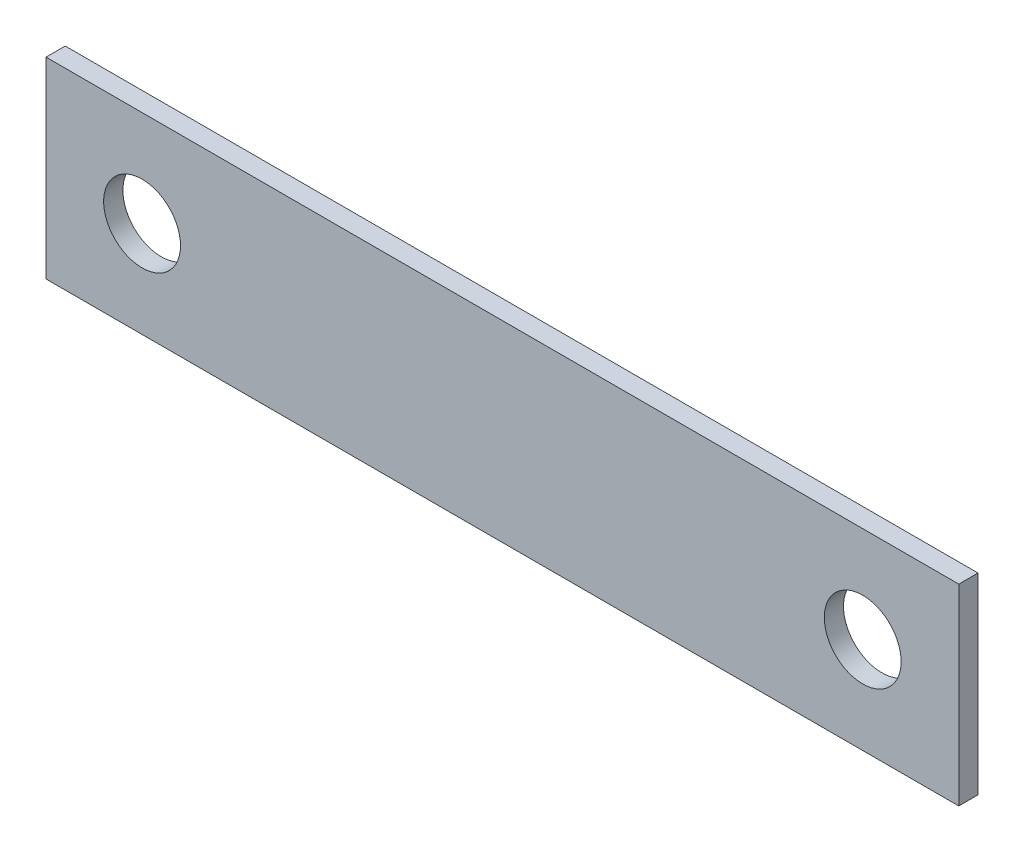
ISO-10303-21;
HEADER;
FILE_DESCRIPTION(('STEP AP214'),'2;1');
FILE_NAME('part.step','',(''),(''),'','','');
FILE_SCHEMA(('AUTOMOTIVE_DESIGN { 1 0 10303 214 1 1 1 1 }'));
ENDSEC;
DATA;
#1=APPLICATION_CONTEXT('core data for automotive mechanical design processes');
#2=APPLICATION_PROTOCOL_DEFINITION('international standard','automotive_design',2000,#1);
#3=PRODUCT_CONTEXT('',#1,'mechanical');
#4=PRODUCT('Part','Part','',(#3));
#5=PRODUCT_RELATED_PRODUCT_CATEGORY('part','',(#4));
#6=PRODUCT_DEFINITION_FORMATION('','',#4);
#7=PRODUCT_DEFINITION_CONTEXT('part definition',#1,'design');
#8=PRODUCT_DEFINITION('design','',#6,#7);
#9=PRODUCT_DEFINITION_SHAPE('','',#8);
#10=(LENGTH_UNIT() NAMED_UNIT(*) SI_UNIT(.MILLI.,.METRE.));
#11=(NAMED_UNIT(*) PLANE_ANGLE_UNIT() SI_UNIT($,.RADIAN.));
#12=(NAMED_UNIT(*) SI_UNIT($,.STERADIAN.) SOLID_ANGLE_UNIT());
#13=UNCERTAINTY_MEASURE_WITH_UNIT(LENGTH_MEASURE(1.E-05),#10,'distance_accuracy_value','');
#14=(GEOMETRIC_REPRESENTATION_CONTEXT(3) GLOBAL_UNCERTAINTY_ASSIGNED_CONTEXT((#13)) GLOBAL_UNIT_ASSIGNED_CONTEXT((#10,
#11,#12)) REPRESENTATION_CONTEXT('',''));
#15=CARTESIAN_POINT('',(0.,0.,0.));
#16=DIRECTION('',(0.,0.,1.));
#17=DIRECTION('',(1.,0.,0.));
#18=AXIS2_PLACEMENT_3D('',#15,#16,#17);
#19=CARTESIAN_POINT('',(47.5,-10.,0.));
#20=DIRECTION('',(1.,0.,0.));
#21=DIRECTION('',(0.,1.,0.));
#22=AXIS2_PLACEMENT_3D('',#19,#20,#21);
#23=PLANE('',#22);
#24=DIRECTION('',(0.,0.,1.));
#25=VECTOR('',#24,1.);
#26=CARTESIAN_POINT('',(47.5,-10.,0.));
#27=LINE('',#26,#25);
#28=CARTESIAN_POINT('',(47.5,-10.,-2.));
#29=VERTEX_POINT('',#28);
#30=CARTESIAN_POINT('',(47.5,-10.,0.));
#31=VERTEX_POINT('',#30);
#32=EDGE_CURVE('E11',#29,#31,#27,.T.);
#33=ORIENTED_EDGE('',*,*,#32,.F.);
#34=DIRECTION('',(0.,1.,0.));
#35=VECTOR('',#34,1.);
#36=CARTESIAN_POINT('',(47.5,0.,-2.));
#37=LINE('',#36,#35);
#38=CARTESIAN_POINT('',(47.5,10.,-2.));
#39=VERTEX_POINT('',#38);
#40=EDGE_CURVE('E91',#29,#39,#37,.T.);
#41=ORIENTED_EDGE('',*,*,#40,.T.);
#42=DIRECTION('',(0.,0.,1.));
#43=VECTOR('',#42,1.);
#44=CARTESIAN_POINT('',(47.5,10.,0.));
#45=LINE('',#44,#43);
#46=CARTESIAN_POINT('',(47.5,10.,0.));
#47=VERTEX_POINT('',#46);
#48=EDGE_CURVE('E47',#39,#47,#45,.T.);
#49=ORIENTED_EDGE('',*,*,#48,.T.);
#50=DIRECTION('',(0.,1.,0.));
#51=VECTOR('',#50,1.);
#52=CARTESIAN_POINT('',(47.5,-10.,0.));
#53=LINE('',#52,#51);
#54=EDGE_CURVE('E107',#31,#47,#53,.T.);
#55=ORIENTED_EDGE('',*,*,#54,.F.);
#56=EDGE_LOOP('',(#33,#41,#49,#55));
#57=FACE_BOUND('',#56,.T.);
#58=ADVANCED_FACE('F37',(#57),#23,.T.);
#59=CARTESIAN_POINT('',(47.5,10.,0.));
#60=DIRECTION('',(0.,1.,0.));
#61=DIRECTION('',(-1.,0.,0.));
#62=AXIS2_PLACEMENT_3D('',#59,#60,#61);
#63=PLANE('',#62);
#64=ORIENTED_EDGE('',*,*,#48,.F.);
#65=DIRECTION('',(1.,0.,0.));
#66=VECTOR('',#65,1.);
#67=CARTESIAN_POINT('',(0.,10.,-2.));
#68=LINE('',#67,#66);
#69=CARTESIAN_POINT('',(-47.5,9.99999999999999,-2.));
#70=VERTEX_POINT('',#69);
#71=EDGE_CURVE('E101',#39,#70,#68,.F.);
#72=ORIENTED_EDGE('',*,*,#71,.T.);
#73=DIRECTION('',(0.,0.,1.));
#74=VECTOR('',#73,1.);
#75=CARTESIAN_POINT('',(-47.5,9.99999999999999,0.));
#76=LINE('',#75,#74);
#77=CARTESIAN_POINT('',(-47.5,9.99999999999999,0.));
#78=VERTEX_POINT('',#77);
#79=EDGE_CURVE('E55',#70,#78,#76,.T.);
#80=ORIENTED_EDGE('',*,*,#79,.T.);
#81=DIRECTION('',(-1.,0.,0.));
#82=VECTOR('',#81,1.);
#83=CARTESIAN_POINT('',(47.5,10.,0.));
#84=LINE('',#83,#82);
#85=EDGE_CURVE('E85',#47,#78,#84,.T.);
#86=ORIENTED_EDGE('',*,*,#85,.F.);
#87=EDGE_LOOP('',(#64,#72,#80,#86));
#88=FACE_BOUND('',#87,.T.);
#89=ADVANCED_FACE('F112',(#88),#63,.T.);
#90=CARTESIAN_POINT('',(-47.5,-10.,0.));
#91=DIRECTION('',(-1.,0.,0.));
#92=DIRECTION('',(0.,-1.,0.));
#93=AXIS2_PLACEMENT_3D('',#90,#91,#92);
#94=PLANE('',#93);
#95=ORIENTED_EDGE('',*,*,#79,.F.);
#96=DIRECTION('',(0.,1.,0.));
#97=VECTOR('',#96,1.);
#98=CARTESIAN_POINT('',(-47.5,0.,-2.));
#99=LINE('',#98,#97);
#100=CARTESIAN_POINT('',(-47.5,-10.,-2.));
#101=VERTEX_POINT('',#100);
#102=EDGE_CURVE('E90',#70,#101,#99,.F.);
#103=ORIENTED_EDGE('',*,*,#102,.T.);
#104=DIRECTION('',(0.,0.,1.));
#105=VECTOR('',#104,1.);
#106=CARTESIAN_POINT('',(-47.5,-10.,0.));
#107=LINE('',#106,#105);
#108=CARTESIAN_POINT('',(-47.5,-10.,0.));
#109=VERTEX_POINT('',#108);
#110=EDGE_CURVE('E41',#101,#109,#107,.T.);
#111=ORIENTED_EDGE('',*,*,#110,.T.);
#112=DIRECTION('',(0.,-1.,0.));
#113=VECTOR('',#112,1.);
#114=CARTESIAN_POINT('',(-47.5,-10.,0.));
#115=LINE('',#114,#113);
#116=EDGE_CURVE('E227',#78,#109,#115,.T.);
#117=ORIENTED_EDGE('',*,*,#116,.F.);
#118=EDGE_LOOP('',(#95,#103,#111,#117));
#119=FACE_BOUND('',#118,.T.);
#120=ADVANCED_FACE('F93',(#119),#94,.T.);
#121=CARTESIAN_POINT('',(-37.5,0.,0.));
#122=DIRECTION('',(0.,0.,1.));
#123=DIRECTION('',(1.,0.,0.));
#124=AXIS2_PLACEMENT_3D('',#121,#122,#123);
#125=CYLINDRICAL_SURFACE('',#124,4.);
#126=CARTESIAN_POINT('',(-37.5,0.,0.));
#127=DIRECTION('',(0.,0.,1.));
#128=DIRECTION('',(1.,0.,0.));
#129=AXIS2_PLACEMENT_3D('',#126,#127,#128);
#130=CIRCLE('',#129,4.);
#131=CARTESIAN_POINT('',(-33.5,0.,0.));
#132=VERTEX_POINT('',#131);
#133=EDGE_CURVE('E103',#132,#132,#130,.T.);
#134=ORIENTED_EDGE('',*,*,#133,.T.);
#135=EDGE_LOOP('',(#134));
#136=FACE_BOUND('',#135,.T.);
#137=CARTESIAN_POINT('',(-37.5,0.,-2.));
#138=DIRECTION('',(0.,0.,1.));
#139=DIRECTION('',(1.,0.,0.));
#140=AXIS2_PLACEMENT_3D('',#137,#138,#139);
#141=CIRCLE('',#140,4.);
#142=CARTESIAN_POINT('',(-33.5,0.,-2.));
#143=VERTEX_POINT('',#142);
#144=EDGE_CURVE('E97',#143,#143,#141,.T.);
#145=ORIENTED_EDGE('',*,*,#144,.F.);
#146=EDGE_LOOP('',(#145));
#147=FACE_BOUND('',#146,.T.);
#148=ADVANCED_FACE('F120',(#136,#147),#125,.F.);
#149=CARTESIAN_POINT('',(37.5,0.,0.));
#150=DIRECTION('',(0.,0.,1.));
#151=DIRECTION('',(1.,0.,0.));
#152=AXIS2_PLACEMENT_3D('',#149,#150,#151);
#153=CYLINDRICAL_SURFACE('',#152,4.);
#154=CARTESIAN_POINT('',(37.5,0.,0.));
#155=DIRECTION('',(0.,0.,1.));
#156=DIRECTION('',(1.,0.,0.));
#157=AXIS2_PLACEMENT_3D('',#154,#155,#156);
#158=CIRCLE('',#157,4.);
#159=CARTESIAN_POINT('',(41.5,0.,0.));
#160=VERTEX_POINT('',#159);
#161=EDGE_CURVE('E226',#160,#160,#158,.T.);
#162=ORIENTED_EDGE('',*,*,#161,.T.);
#163=EDGE_LOOP('',(#162));
#164=FACE_BOUND('',#163,.T.);
#165=CARTESIAN_POINT('',(37.5,0.,-2.));
#166=DIRECTION('',(0.,0.,1.));
#167=DIRECTION('',(1.,0.,0.));
#168=AXIS2_PLACEMENT_3D('',#165,#166,#167);
#169=CIRCLE('',#168,4.);
#170=CARTESIAN_POINT('',(41.5,0.,-2.));
#171=VERTEX_POINT('',#170);
#172=EDGE_CURVE('E94',#171,#171,#169,.T.);
#173=ORIENTED_EDGE('',*,*,#172,.F.);
#174=EDGE_LOOP('',(#173));
#175=FACE_BOUND('',#174,.T.);
#176=ADVANCED_FACE('F122',(#164,#175),#153,.F.);
#177=CARTESIAN_POINT('',(47.5,-10.,0.));
#178=DIRECTION('',(0.,-1.,0.));
#179=DIRECTION('',(1.,0.,0.));
#180=AXIS2_PLACEMENT_3D('',#177,#178,#179);
#181=PLANE('',#180);
#182=DIRECTION('',(1.,0.,0.));
#183=VECTOR('',#182,1.);
#184=CARTESIAN_POINT('',(0.,-10.,-2.));
#185=LINE('',#184,#183);
#186=EDGE_CURVE('E79',#101,#29,#185,.T.);
#187=ORIENTED_EDGE('',*,*,#186,.T.);
#188=ORIENTED_EDGE('',*,*,#32,.T.);
#189=DIRECTION('',(1.,0.,0.));
#190=VECTOR('',#189,1.);
#191=CARTESIAN_POINT('',(47.5,-10.,0.));
#192=LINE('',#191,#190);
#193=EDGE_CURVE('E81',#109,#31,#192,.T.);
#194=ORIENTED_EDGE('',*,*,#193,.F.);
#195=ORIENTED_EDGE('',*,*,#110,.F.);
#196=EDGE_LOOP('',(#187,#188,#194,#195));
#197=FACE_BOUND('',#196,.T.);
#198=ADVANCED_FACE('F39',(#197),#181,.T.);
#199=CARTESIAN_POINT('',(0.,0.,0.));
#200=DIRECTION('',(0.,0.,1.));
#201=DIRECTION('',(1.,0.,0.));
#202=AXIS2_PLACEMENT_3D('',#199,#200,#201);
#203=PLANE('',#202);
#204=ORIENTED_EDGE('',*,*,#133,.F.);
#205=EDGE_LOOP('',(#204));
#206=FACE_BOUND('',#205,.T.);
#207=ORIENTED_EDGE('',*,*,#161,.F.);
#208=EDGE_LOOP('',(#207));
#209=FACE_BOUND('',#208,.T.);
#210=ORIENTED_EDGE('',*,*,#116,.T.);
#211=ORIENTED_EDGE('',*,*,#193,.T.);
#212=ORIENTED_EDGE('',*,*,#54,.T.);
#213=ORIENTED_EDGE('',*,*,#85,.T.);
#214=EDGE_LOOP('',(#210,#211,#212,#213));
#215=FACE_BOUND('',#214,.T.);
#216=ADVANCED_FACE('F110',(#206,#209,#215),#203,.T.);
#217=CARTESIAN_POINT('',(0.,0.,-2.));
#218=DIRECTION('',(0.,0.,1.));
#219=DIRECTION('',(1.,0.,0.));
#220=AXIS2_PLACEMENT_3D('',#217,#218,#219);
#221=PLANE('',#220);
#222=ORIENTED_EDGE('',*,*,#144,.T.);
#223=EDGE_LOOP('',(#222));
#224=FACE_BOUND('',#223,.T.);
#225=ORIENTED_EDGE('',*,*,#172,.T.);
#226=EDGE_LOOP('',(#225));
#227=FACE_BOUND('',#226,.T.);
#228=ORIENTED_EDGE('',*,*,#102,.F.);
#229=ORIENTED_EDGE('',*,*,#71,.F.);
#230=ORIENTED_EDGE('',*,*,#40,.F.);
#231=ORIENTED_EDGE('',*,*,#186,.F.);
#232=EDGE_LOOP('',(#228,#229,#230,#231));
#233=FACE_BOUND('',#232,.T.);
#234=ADVANCED_FACE('F88',(#224,#227,#233),#221,.F.);
#235=CLOSED_SHELL('',(#58,#89,#120,#148,#176,#198,#216,#234));
#236=MANIFOLD_SOLID_BREP('B2',#235);
#237=ADVANCED_BREP_SHAPE_REPRESENTATION('',(#18,#236),#14);
#238=SHAPE_DEFINITION_REPRESENTATION(#9,#237);
ENDSEC;
END-ISO-10303-21;
